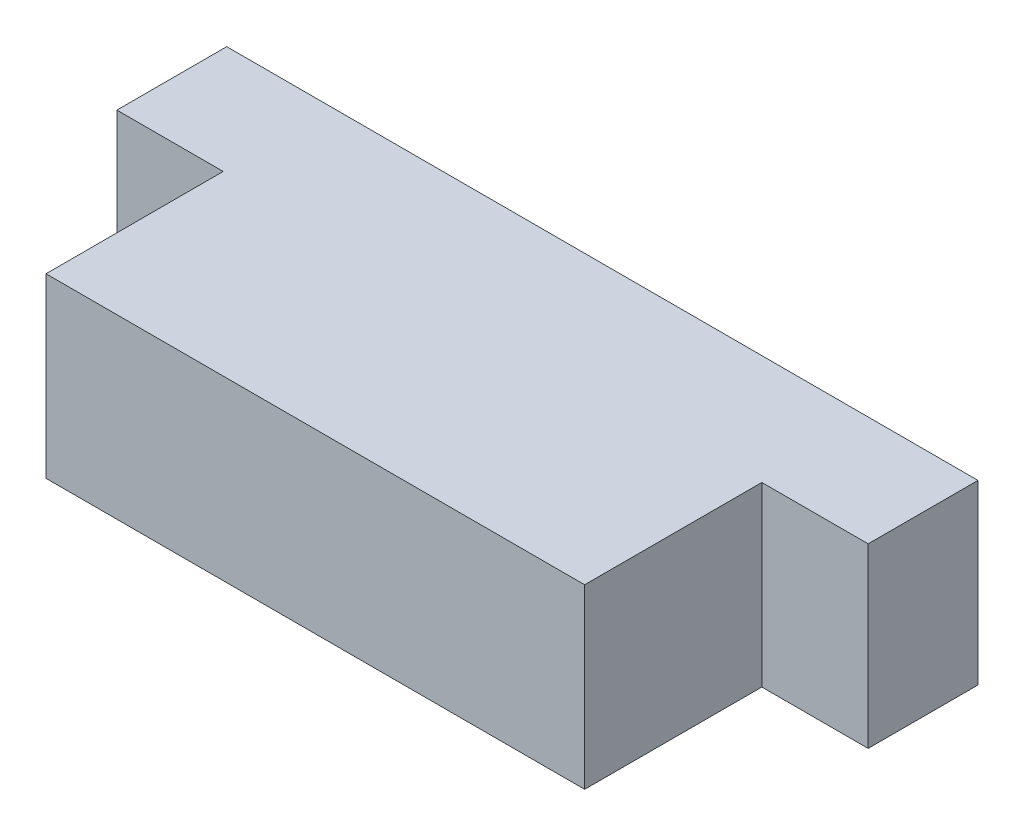
ISO-10303-21;
HEADER;
FILE_DESCRIPTION(('STEP AP214'),'2;1');
FILE_NAME('part.step','',(''),(''),'','','');
FILE_SCHEMA(('AUTOMOTIVE_DESIGN { 1 0 10303 214 1 1 1 1 }'));
ENDSEC;
DATA;
#1=APPLICATION_CONTEXT('core data for automotive mechanical design processes');
#2=APPLICATION_PROTOCOL_DEFINITION('international standard','automotive_design',2000,#1);
#3=PRODUCT_CONTEXT('',#1,'mechanical');
#4=PRODUCT('Part','Part','',(#3));
#5=PRODUCT_RELATED_PRODUCT_CATEGORY('part','',(#4));
#6=PRODUCT_DEFINITION_FORMATION('','',#4);
#7=PRODUCT_DEFINITION_CONTEXT('part definition',#1,'design');
#8=PRODUCT_DEFINITION('design','',#6,#7);
#9=PRODUCT_DEFINITION_SHAPE('','',#8);
#10=(LENGTH_UNIT() NAMED_UNIT(*) SI_UNIT(.MILLI.,.METRE.));
#11=(NAMED_UNIT(*) PLANE_ANGLE_UNIT() SI_UNIT($,.RADIAN.));
#12=(NAMED_UNIT(*) SI_UNIT($,.STERADIAN.) SOLID_ANGLE_UNIT());
#13=UNCERTAINTY_MEASURE_WITH_UNIT(LENGTH_MEASURE(1.E-05),#10,'distance_accuracy_value','');
#14=(GEOMETRIC_REPRESENTATION_CONTEXT(3) GLOBAL_UNCERTAINTY_ASSIGNED_CONTEXT((#13)) GLOBAL_UNIT_ASSIGNED_CONTEXT((#10,
#11,#12)) REPRESENTATION_CONTEXT('',''));
#15=CARTESIAN_POINT('',(0.,0.,0.));
#16=DIRECTION('',(0.,0.,1.));
#17=DIRECTION('',(1.,0.,0.));
#18=AXIS2_PLACEMENT_3D('',#15,#16,#17);
#19=CARTESIAN_POINT('',(15.2,5.,0.));
#20=DIRECTION('',(0.,0.,-1.));
#21=DIRECTION('',(-1.,0.,0.));
#22=AXIS2_PLACEMENT_3D('',#19,#20,#21);
#23=PLANE('',#22);
#24=DIRECTION('',(1.,0.,0.));
#25=VECTOR('',#24,1.);
#26=CARTESIAN_POINT('',(15.2,0.,0.));
#27=LINE('',#26,#25);
#28=CARTESIAN_POINT('',(0.,0.,0.));
#29=VERTEX_POINT('',#28);
#30=CARTESIAN_POINT('',(15.2,0.,0.));
#31=VERTEX_POINT('',#30);
#32=EDGE_CURVE('E130',#29,#31,#27,.T.);
#33=ORIENTED_EDGE('',*,*,#32,.T.);
#34=DIRECTION('',(0.,-1.,0.));
#35=VECTOR('',#34,1.);
#36=CARTESIAN_POINT('',(15.2,5.,0.));
#37=LINE('',#36,#35);
#38=CARTESIAN_POINT('',(15.2,5.,0.));
#39=VERTEX_POINT('',#38);
#40=EDGE_CURVE('E11',#39,#31,#37,.T.);
#41=ORIENTED_EDGE('',*,*,#40,.F.);
#42=DIRECTION('',(1.,0.,0.));
#43=VECTOR('',#42,1.);
#44=CARTESIAN_POINT('',(15.2,5.,0.));
#45=LINE('',#44,#43);
#46=CARTESIAN_POINT('',(0.,5.,0.));
#47=VERTEX_POINT('',#46);
#48=EDGE_CURVE('E144',#47,#39,#45,.T.);
#49=ORIENTED_EDGE('',*,*,#48,.F.);
#50=DIRECTION('',(0.,-1.,0.));
#51=VECTOR('',#50,1.);
#52=CARTESIAN_POINT('',(0.,5.,0.));
#53=LINE('',#52,#51);
#54=EDGE_CURVE('E126',#47,#29,#53,.T.);
#55=ORIENTED_EDGE('',*,*,#54,.T.);
#56=EDGE_LOOP('',(#33,#41,#49,#55));
#57=FACE_BOUND('',#56,.T.);
#58=ADVANCED_FACE('F34',(#57),#23,.F.);
#59=CARTESIAN_POINT('',(15.2,5.,-5.));
#60=DIRECTION('',(-1.,0.,0.));
#61=DIRECTION('',(0.,0.,1.));
#62=AXIS2_PLACEMENT_3D('',#59,#60,#61);
#63=PLANE('',#62);
#64=DIRECTION('',(0.,0.,-1.));
#65=VECTOR('',#64,1.);
#66=CARTESIAN_POINT('',(15.2,0.,-5.));
#67=LINE('',#66,#65);
#68=CARTESIAN_POINT('',(15.2,0.,-5.));
#69=VERTEX_POINT('',#68);
#70=EDGE_CURVE('E133',#31,#69,#67,.T.);
#71=ORIENTED_EDGE('',*,*,#70,.T.);
#72=DIRECTION('',(0.,-1.,0.));
#73=VECTOR('',#72,1.);
#74=CARTESIAN_POINT('',(15.2,5.,-5.));
#75=LINE('',#74,#73);
#76=CARTESIAN_POINT('',(15.2,5.,-5.));
#77=VERTEX_POINT('',#76);
#78=EDGE_CURVE('E42',#77,#69,#75,.T.);
#79=ORIENTED_EDGE('',*,*,#78,.F.);
#80=DIRECTION('',(0.,0.,-1.));
#81=VECTOR('',#80,1.);
#82=CARTESIAN_POINT('',(15.2,5.,-5.));
#83=LINE('',#82,#81);
#84=EDGE_CURVE('E93',#39,#77,#83,.T.);
#85=ORIENTED_EDGE('',*,*,#84,.F.);
#86=ORIENTED_EDGE('',*,*,#40,.T.);
#87=EDGE_LOOP('',(#71,#79,#85,#86));
#88=FACE_BOUND('',#87,.T.);
#89=ADVANCED_FACE('F179',(#88),#63,.F.);
#90=CARTESIAN_POINT('',(18.2,5.,-5.));
#91=DIRECTION('',(0.,0.,-1.));
#92=DIRECTION('',(-1.,0.,0.));
#93=AXIS2_PLACEMENT_3D('',#90,#91,#92);
#94=PLANE('',#93);
#95=DIRECTION('',(1.,0.,0.));
#96=VECTOR('',#95,1.);
#97=CARTESIAN_POINT('',(18.2,0.,-5.));
#98=LINE('',#97,#96);
#99=CARTESIAN_POINT('',(18.2,0.,-5.));
#100=VERTEX_POINT('',#99);
#101=EDGE_CURVE('E135',#69,#100,#98,.T.);
#102=ORIENTED_EDGE('',*,*,#101,.T.);
#103=DIRECTION('',(0.,-1.,0.));
#104=VECTOR('',#103,1.);
#105=CARTESIAN_POINT('',(18.2,5.,-5.));
#106=LINE('',#105,#104);
#107=CARTESIAN_POINT('',(18.2,5.,-5.));
#108=VERTEX_POINT('',#107);
#109=EDGE_CURVE('E151',#108,#100,#106,.T.);
#110=ORIENTED_EDGE('',*,*,#109,.F.);
#111=DIRECTION('',(1.,0.,0.));
#112=VECTOR('',#111,1.);
#113=CARTESIAN_POINT('',(18.2,5.,-5.));
#114=LINE('',#113,#112);
#115=EDGE_CURVE('E159',#77,#108,#114,.T.);
#116=ORIENTED_EDGE('',*,*,#115,.F.);
#117=ORIENTED_EDGE('',*,*,#78,.T.);
#118=EDGE_LOOP('',(#102,#110,#116,#117));
#119=FACE_BOUND('',#118,.T.);
#120=ADVANCED_FACE('F157',(#119),#94,.F.);
#121=CARTESIAN_POINT('',(18.2,5.,-8.1));
#122=DIRECTION('',(-1.,0.,0.));
#123=DIRECTION('',(0.,0.,1.));
#124=AXIS2_PLACEMENT_3D('',#121,#122,#123);
#125=PLANE('',#124);
#126=DIRECTION('',(0.,0.,-1.));
#127=VECTOR('',#126,1.);
#128=CARTESIAN_POINT('',(18.2,0.,-8.1));
#129=LINE('',#128,#127);
#130=CARTESIAN_POINT('',(18.2,0.,-8.1));
#131=VERTEX_POINT('',#130);
#132=EDGE_CURVE('E137',#100,#131,#129,.T.);
#133=ORIENTED_EDGE('',*,*,#132,.T.);
#134=DIRECTION('',(0.,-1.,0.));
#135=VECTOR('',#134,1.);
#136=CARTESIAN_POINT('',(18.2,5.,-8.1));
#137=LINE('',#136,#135);
#138=CARTESIAN_POINT('',(18.2,5.,-8.1));
#139=VERTEX_POINT('',#138);
#140=EDGE_CURVE('E148',#139,#131,#137,.T.);
#141=ORIENTED_EDGE('',*,*,#140,.F.);
#142=DIRECTION('',(0.,0.,-1.));
#143=VECTOR('',#142,1.);
#144=CARTESIAN_POINT('',(18.2,5.,-8.1));
#145=LINE('',#144,#143);
#146=EDGE_CURVE('E171',#108,#139,#145,.T.);
#147=ORIENTED_EDGE('',*,*,#146,.F.);
#148=ORIENTED_EDGE('',*,*,#109,.T.);
#149=EDGE_LOOP('',(#133,#141,#147,#148));
#150=FACE_BOUND('',#149,.T.);
#151=ADVANCED_FACE('F167',(#150),#125,.F.);
#152=CARTESIAN_POINT('',(-3.,5.,-8.1));
#153=DIRECTION('',(0.,0.,1.));
#154=DIRECTION('',(1.,0.,0.));
#155=AXIS2_PLACEMENT_3D('',#152,#153,#154);
#156=PLANE('',#155);
#157=DIRECTION('',(-1.,0.,0.));
#158=VECTOR('',#157,1.);
#159=CARTESIAN_POINT('',(-3.,0.,-8.1));
#160=LINE('',#159,#158);
#161=CARTESIAN_POINT('',(-3.,0.,-8.1));
#162=VERTEX_POINT('',#161);
#163=EDGE_CURVE('E139',#131,#162,#160,.T.);
#164=ORIENTED_EDGE('',*,*,#163,.T.);
#165=DIRECTION('',(0.,-1.,0.));
#166=VECTOR('',#165,1.);
#167=CARTESIAN_POINT('',(-3.,5.,-8.1));
#168=LINE('',#167,#166);
#169=CARTESIAN_POINT('',(-3.,5.,-8.1));
#170=VERTEX_POINT('',#169);
#171=EDGE_CURVE('E121',#170,#162,#168,.T.);
#172=ORIENTED_EDGE('',*,*,#171,.F.);
#173=DIRECTION('',(-1.,0.,0.));
#174=VECTOR('',#173,1.);
#175=CARTESIAN_POINT('',(-3.,5.,-8.1));
#176=LINE('',#175,#174);
#177=EDGE_CURVE('E112',#139,#170,#176,.T.);
#178=ORIENTED_EDGE('',*,*,#177,.F.);
#179=ORIENTED_EDGE('',*,*,#140,.T.);
#180=EDGE_LOOP('',(#164,#172,#178,#179));
#181=FACE_BOUND('',#180,.T.);
#182=ADVANCED_FACE('F170',(#181),#156,.F.);
#183=CARTESIAN_POINT('',(-3.,5.,-5.));
#184=DIRECTION('',(1.,0.,0.));
#185=DIRECTION('',(0.,0.,-1.));
#186=AXIS2_PLACEMENT_3D('',#183,#184,#185);
#187=PLANE('',#186);
#188=DIRECTION('',(0.,0.,1.));
#189=VECTOR('',#188,1.);
#190=CARTESIAN_POINT('',(-3.,0.,-5.));
#191=LINE('',#190,#189);
#192=CARTESIAN_POINT('',(-3.,0.,-5.));
#193=VERTEX_POINT('',#192);
#194=EDGE_CURVE('E120',#162,#193,#191,.T.);
#195=ORIENTED_EDGE('',*,*,#194,.T.);
#196=DIRECTION('',(0.,-1.,0.));
#197=VECTOR('',#196,1.);
#198=CARTESIAN_POINT('',(-3.,5.,-5.));
#199=LINE('',#198,#197);
#200=CARTESIAN_POINT('',(-3.,5.,-5.));
#201=VERTEX_POINT('',#200);
#202=EDGE_CURVE('E117',#201,#193,#199,.T.);
#203=ORIENTED_EDGE('',*,*,#202,.F.);
#204=DIRECTION('',(0.,0.,1.));
#205=VECTOR('',#204,1.);
#206=CARTESIAN_POINT('',(-3.,5.,-5.));
#207=LINE('',#206,#205);
#208=EDGE_CURVE('E106',#170,#201,#207,.T.);
#209=ORIENTED_EDGE('',*,*,#208,.F.);
#210=ORIENTED_EDGE('',*,*,#171,.T.);
#211=EDGE_LOOP('',(#195,#203,#209,#210));
#212=FACE_BOUND('',#211,.T.);
#213=ADVANCED_FACE('F118',(#212),#187,.F.);
#214=CARTESIAN_POINT('',(0.,5.,-5.));
#215=DIRECTION('',(0.,0.,-1.));
#216=DIRECTION('',(-1.,0.,0.));
#217=AXIS2_PLACEMENT_3D('',#214,#215,#216);
#218=PLANE('',#217);
#219=DIRECTION('',(1.,0.,0.));
#220=VECTOR('',#219,1.);
#221=CARTESIAN_POINT('',(0.,0.,-5.));
#222=LINE('',#221,#220);
#223=CARTESIAN_POINT('',(0.,0.,-5.));
#224=VERTEX_POINT('',#223);
#225=EDGE_CURVE('E79',#193,#224,#222,.T.);
#226=ORIENTED_EDGE('',*,*,#225,.T.);
#227=DIRECTION('',(0.,-1.,0.));
#228=VECTOR('',#227,1.);
#229=CARTESIAN_POINT('',(0.,5.,-5.));
#230=LINE('',#229,#228);
#231=CARTESIAN_POINT('',(0.,5.,-5.));
#232=VERTEX_POINT('',#231);
#233=EDGE_CURVE('E122',#232,#224,#230,.T.);
#234=ORIENTED_EDGE('',*,*,#233,.F.);
#235=DIRECTION('',(1.,0.,0.));
#236=VECTOR('',#235,1.);
#237=CARTESIAN_POINT('',(0.,5.,-5.));
#238=LINE('',#237,#236);
#239=EDGE_CURVE('E110',#201,#232,#238,.T.);
#240=ORIENTED_EDGE('',*,*,#239,.F.);
#241=ORIENTED_EDGE('',*,*,#202,.T.);
#242=EDGE_LOOP('',(#226,#234,#240,#241));
#243=FACE_BOUND('',#242,.T.);
#244=ADVANCED_FACE('F124',(#243),#218,.F.);
#245=CARTESIAN_POINT('',(0.,5.,0.));
#246=DIRECTION('',(1.,0.,0.));
#247=DIRECTION('',(0.,0.,-1.));
#248=AXIS2_PLACEMENT_3D('',#245,#246,#247);
#249=PLANE('',#248);
#250=DIRECTION('',(0.,0.,1.));
#251=VECTOR('',#250,1.);
#252=CARTESIAN_POINT('',(0.,0.,0.));
#253=LINE('',#252,#251);
#254=EDGE_CURVE('E85',#224,#29,#253,.T.);
#255=ORIENTED_EDGE('',*,*,#254,.T.);
#256=ORIENTED_EDGE('',*,*,#54,.F.);
#257=DIRECTION('',(0.,0.,1.));
#258=VECTOR('',#257,1.);
#259=CARTESIAN_POINT('',(0.,5.,0.));
#260=LINE('',#259,#258);
#261=EDGE_CURVE('E50',#232,#47,#260,.T.);
#262=ORIENTED_EDGE('',*,*,#261,.F.);
#263=ORIENTED_EDGE('',*,*,#233,.T.);
#264=EDGE_LOOP('',(#255,#256,#262,#263));
#265=FACE_BOUND('',#264,.T.);
#266=ADVANCED_FACE('F195',(#265),#249,.F.);
#267=CARTESIAN_POINT('',(0.,5.,0.));
#268=DIRECTION('',(0.,-1.,0.));
#269=DIRECTION('',(0.,0.,-1.));
#270=AXIS2_PLACEMENT_3D('',#267,#268,#269);
#271=PLANE('',#270);
#272=ORIENTED_EDGE('',*,*,#48,.T.);
#273=ORIENTED_EDGE('',*,*,#84,.T.);
#274=ORIENTED_EDGE('',*,*,#115,.T.);
#275=ORIENTED_EDGE('',*,*,#146,.T.);
#276=ORIENTED_EDGE('',*,*,#177,.T.);
#277=ORIENTED_EDGE('',*,*,#208,.T.);
#278=ORIENTED_EDGE('',*,*,#239,.T.);
#279=ORIENTED_EDGE('',*,*,#261,.T.);
#280=EDGE_LOOP('',(#272,#273,#274,#275,#276,#277,#278,#279));
#281=FACE_BOUND('',#280,.T.);
#282=ADVANCED_FACE('F108',(#281),#271,.F.);
#283=CARTESIAN_POINT('',(0.,0.,0.));
#284=DIRECTION('',(0.,-1.,0.));
#285=DIRECTION('',(0.,0.,-1.));
#286=AXIS2_PLACEMENT_3D('',#283,#284,#285);
#287=PLANE('',#286);
#288=ORIENTED_EDGE('',*,*,#32,.F.);
#289=ORIENTED_EDGE('',*,*,#254,.F.);
#290=ORIENTED_EDGE('',*,*,#225,.F.);
#291=ORIENTED_EDGE('',*,*,#194,.F.);
#292=ORIENTED_EDGE('',*,*,#163,.F.);
#293=ORIENTED_EDGE('',*,*,#132,.F.);
#294=ORIENTED_EDGE('',*,*,#101,.F.);
#295=ORIENTED_EDGE('',*,*,#70,.F.);
#296=EDGE_LOOP('',(#288,#289,#290,#291,#292,#293,#294,#295));
#297=FACE_BOUND('',#296,.T.);
#298=ADVANCED_FACE('F163',(#297),#287,.T.);
#299=CLOSED_SHELL('',(#58,#89,#120,#151,#182,#213,#244,#266,#282,#298));
#300=MANIFOLD_SOLID_BREP('B2',#299);
#301=ADVANCED_BREP_SHAPE_REPRESENTATION('',(#18,#300),#14);
#302=SHAPE_DEFINITION_REPRESENTATION(#9,#301);
ENDSEC;
END-ISO-10303-21;
